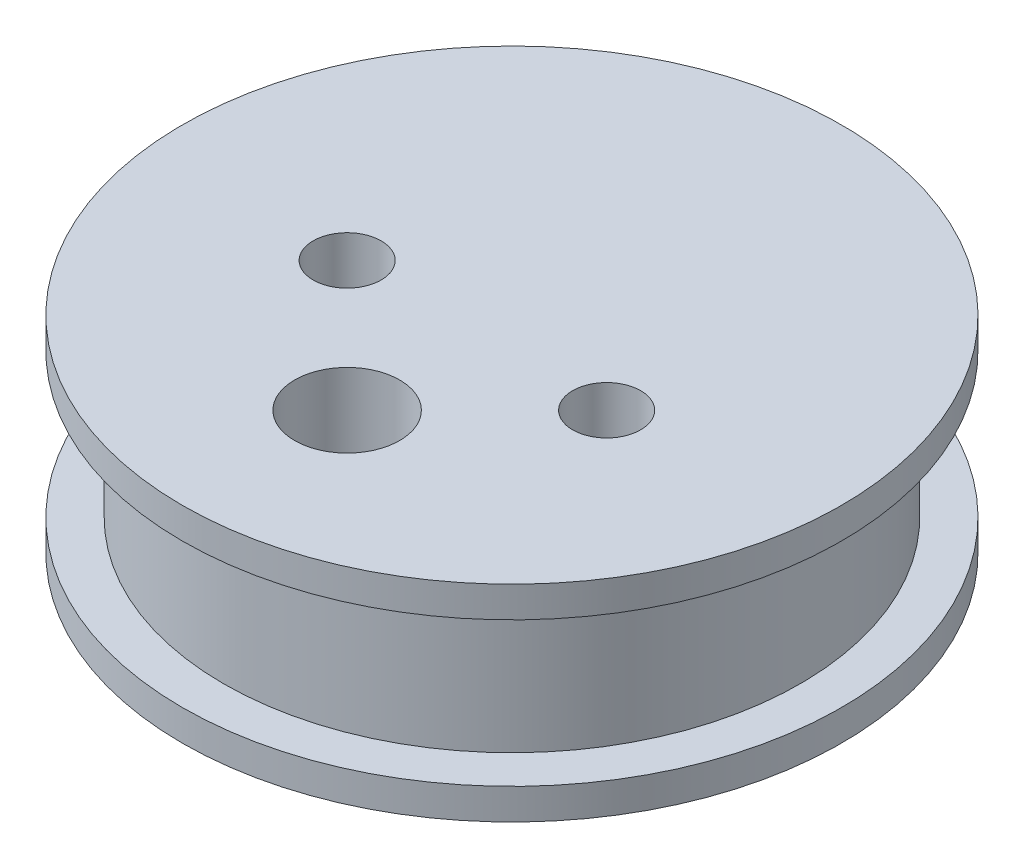
ISO-10303-21;
HEADER;
FILE_DESCRIPTION(('STEP AP214'),'2;1');
FILE_NAME('part.step','',(''),(''),'','','');
FILE_SCHEMA(('AUTOMOTIVE_DESIGN { 1 0 10303 214 1 1 1 1 }'));
ENDSEC;
DATA;
#1=APPLICATION_CONTEXT('core data for automotive mechanical design processes');
#2=APPLICATION_PROTOCOL_DEFINITION('international standard','automotive_design',2000,#1);
#3=PRODUCT_CONTEXT('',#1,'mechanical');
#4=PRODUCT('Part','Part','',(#3));
#5=PRODUCT_RELATED_PRODUCT_CATEGORY('part','',(#4));
#6=PRODUCT_DEFINITION_FORMATION('','',#4);
#7=PRODUCT_DEFINITION_CONTEXT('part definition',#1,'design');
#8=PRODUCT_DEFINITION('design','',#6,#7);
#9=PRODUCT_DEFINITION_SHAPE('','',#8);
#10=(LENGTH_UNIT() NAMED_UNIT(*) SI_UNIT(.MILLI.,.METRE.));
#11=(NAMED_UNIT(*) PLANE_ANGLE_UNIT() SI_UNIT($,.RADIAN.));
#12=(NAMED_UNIT(*) SI_UNIT($,.STERADIAN.) SOLID_ANGLE_UNIT());
#13=UNCERTAINTY_MEASURE_WITH_UNIT(LENGTH_MEASURE(1.E-05),#10,'distance_accuracy_value','');
#14=(GEOMETRIC_REPRESENTATION_CONTEXT(3) GLOBAL_UNCERTAINTY_ASSIGNED_CONTEXT((#13)) GLOBAL_UNIT_ASSIGNED_CONTEXT((#10,
#11,#12)) REPRESENTATION_CONTEXT('',''));
#15=CARTESIAN_POINT('',(0.,0.,0.));
#16=DIRECTION('',(0.,0.,1.));
#17=DIRECTION('',(1.,0.,0.));
#18=AXIS2_PLACEMENT_3D('',#15,#16,#17);
#19=CARTESIAN_POINT('',(30.48,-1.36144358154197,0.));
#20=DIRECTION('',(0.,1.,0.));
#21=DIRECTION('',(0.,0.,1.));
#22=AXIS2_PLACEMENT_3D('',#19,#20,#21);
#23=PLANE('',#22);
#24=CARTESIAN_POINT('',(30.48,-1.36144358154198,10.16));
#25=DIRECTION('',(0.,1.,0.));
#26=DIRECTION('',(-1.,0.,0.));
#27=AXIS2_PLACEMENT_3D('',#24,#25,#26);
#28=CIRCLE('',#27,3.2385);
#29=CARTESIAN_POINT('',(27.2415,-1.36144358154198,10.16));
#30=VERTEX_POINT('',#29);
#31=EDGE_CURVE('E72',#30,#30,#28,.T.);
#32=ORIENTED_EDGE('',*,*,#31,.T.);
#33=EDGE_LOOP('',(#32));
#34=FACE_BOUND('',#33,.T.);
#35=CARTESIAN_POINT('',(22.48,-1.36144358154198,2.16));
#36=DIRECTION('',(0.,1.,0.));
#37=DIRECTION('',(-1.,0.,0.));
#38=AXIS2_PLACEMENT_3D('',#35,#36,#37);
#39=CIRCLE('',#38,2.0955);
#40=CARTESIAN_POINT('',(20.3845,-1.36144358154198,2.16));
#41=VERTEX_POINT('',#40);
#42=EDGE_CURVE('E81',#41,#41,#39,.T.);
#43=ORIENTED_EDGE('',*,*,#42,.T.);
#44=EDGE_LOOP('',(#43));
#45=FACE_BOUND('',#44,.T.);
#46=CARTESIAN_POINT('',(38.48,-1.36144358154197,2.16));
#47=DIRECTION('',(0.,1.,0.));
#48=DIRECTION('',(-1.,0.,0.));
#49=AXIS2_PLACEMENT_3D('',#46,#47,#48);
#50=CIRCLE('',#49,2.0955);
#51=CARTESIAN_POINT('',(36.3845,-1.36144358154197,2.16));
#52=VERTEX_POINT('',#51);
#53=EDGE_CURVE('E73',#52,#52,#50,.T.);
#54=ORIENTED_EDGE('',*,*,#53,.T.);
#55=EDGE_LOOP('',(#54));
#56=FACE_BOUND('',#55,.T.);
#57=CARTESIAN_POINT('',(30.48,-1.36144358154197,0.));
#58=DIRECTION('',(0.,1.,0.));
#59=DIRECTION('',(0.,0.,1.));
#60=AXIS2_PLACEMENT_3D('',#57,#58,#59);
#61=CIRCLE('',#60,20.32);
#62=CARTESIAN_POINT('',(30.48,-1.36144358154197,20.32));
#63=VERTEX_POINT('',#62);
#64=EDGE_CURVE('E10',#63,#63,#61,.T.);
#65=ORIENTED_EDGE('',*,*,#64,.F.);
#66=EDGE_LOOP('',(#65));
#67=FACE_BOUND('',#66,.T.);
#68=ADVANCED_FACE('F41',(#34,#45,#56,#67),#23,.F.);
#69=CARTESIAN_POINT('',(30.48,11.338556418458,0.));
#70=DIRECTION('',(0.,1.,0.));
#71=DIRECTION('',(0.,0.,1.));
#72=AXIS2_PLACEMENT_3D('',#69,#70,#71);
#73=CYLINDRICAL_SURFACE('',#72,20.32);
#74=CARTESIAN_POINT('',(30.48,0.543556418458027,0.));
#75=DIRECTION('',(0.,1.,0.));
#76=DIRECTION('',(0.,0.,1.));
#77=AXIS2_PLACEMENT_3D('',#74,#75,#76);
#78=CIRCLE('',#77,20.32);
#79=CARTESIAN_POINT('',(30.48,0.543556418458027,20.32));
#80=VERTEX_POINT('',#79);
#81=EDGE_CURVE('E48',#80,#80,#78,.T.);
#82=ORIENTED_EDGE('',*,*,#81,.F.);
#83=EDGE_LOOP('',(#82));
#84=FACE_BOUND('',#83,.T.);
#85=ORIENTED_EDGE('',*,*,#64,.T.);
#86=EDGE_LOOP('',(#85));
#87=FACE_BOUND('',#86,.T.);
#88=ADVANCED_FACE('F137',(#84,#87),#73,.T.);
#89=CARTESIAN_POINT('',(50.8,0.543556418458027,0.));
#90=DIRECTION('',(0.,-1.,0.));
#91=DIRECTION('',(0.,0.,-1.));
#92=AXIS2_PLACEMENT_3D('',#89,#90,#91);
#93=PLANE('',#92);
#94=CARTESIAN_POINT('',(30.48,0.543556418458026,0.));
#95=DIRECTION('',(0.,1.,0.));
#96=DIRECTION('',(0.,0.,1.));
#97=AXIS2_PLACEMENT_3D('',#94,#95,#96);
#98=CIRCLE('',#97,17.78);
#99=CARTESIAN_POINT('',(30.48,0.543556418458026,17.78));
#100=VERTEX_POINT('',#99);
#101=EDGE_CURVE('E53',#100,#100,#98,.T.);
#102=ORIENTED_EDGE('',*,*,#101,.F.);
#103=EDGE_LOOP('',(#102));
#104=FACE_BOUND('',#103,.T.);
#105=ORIENTED_EDGE('',*,*,#81,.T.);
#106=EDGE_LOOP('',(#105));
#107=FACE_BOUND('',#106,.T.);
#108=ADVANCED_FACE('F132',(#104,#107),#93,.F.);
#109=CARTESIAN_POINT('',(30.48,11.338556418458,0.));
#110=DIRECTION('',(0.,1.,0.));
#111=DIRECTION('',(0.,0.,1.));
#112=AXIS2_PLACEMENT_3D('',#109,#110,#111);
#113=CYLINDRICAL_SURFACE('',#112,17.78);
#114=CARTESIAN_POINT('',(30.48,9.43355641845802,0.));
#115=DIRECTION('',(0.,1.,0.));
#116=DIRECTION('',(0.,0.,1.));
#117=AXIS2_PLACEMENT_3D('',#114,#115,#116);
#118=CIRCLE('',#117,17.78);
#119=CARTESIAN_POINT('',(30.48,9.43355641845802,17.78));
#120=VERTEX_POINT('',#119);
#121=EDGE_CURVE('E58',#120,#120,#118,.T.);
#122=ORIENTED_EDGE('',*,*,#121,.F.);
#123=EDGE_LOOP('',(#122));
#124=FACE_BOUND('',#123,.T.);
#125=ORIENTED_EDGE('',*,*,#101,.T.);
#126=EDGE_LOOP('',(#125));
#127=FACE_BOUND('',#126,.T.);
#128=ADVANCED_FACE('F126',(#124,#127),#113,.T.);
#129=CARTESIAN_POINT('',(48.26,9.43355641845802,0.));
#130=DIRECTION('',(0.,1.,0.));
#131=DIRECTION('',(0.,0.,1.));
#132=AXIS2_PLACEMENT_3D('',#129,#130,#131);
#133=PLANE('',#132);
#134=CARTESIAN_POINT('',(30.48,9.43355641845802,0.));
#135=DIRECTION('',(0.,1.,0.));
#136=DIRECTION('',(0.,0.,1.));
#137=AXIS2_PLACEMENT_3D('',#134,#135,#136);
#138=CIRCLE('',#137,20.32);
#139=CARTESIAN_POINT('',(30.48,9.43355641845802,20.32));
#140=VERTEX_POINT('',#139);
#141=EDGE_CURVE('E64',#140,#140,#138,.T.);
#142=ORIENTED_EDGE('',*,*,#141,.F.);
#143=EDGE_LOOP('',(#142));
#144=FACE_BOUND('',#143,.T.);
#145=ORIENTED_EDGE('',*,*,#121,.T.);
#146=EDGE_LOOP('',(#145));
#147=FACE_BOUND('',#146,.T.);
#148=ADVANCED_FACE('F120',(#144,#147),#133,.F.);
#149=CARTESIAN_POINT('',(30.48,11.338556418458,0.));
#150=DIRECTION('',(0.,1.,0.));
#151=DIRECTION('',(0.,0.,1.));
#152=AXIS2_PLACEMENT_3D('',#149,#150,#151);
#153=CYLINDRICAL_SURFACE('',#152,20.32);
#154=CARTESIAN_POINT('',(30.48,11.338556418458,0.));
#155=DIRECTION('',(0.,1.,0.));
#156=DIRECTION('',(0.,0.,1.));
#157=AXIS2_PLACEMENT_3D('',#154,#155,#156);
#158=CIRCLE('',#157,20.32);
#159=CARTESIAN_POINT('',(30.48,11.338556418458,20.32));
#160=VERTEX_POINT('',#159);
#161=EDGE_CURVE('E68',#160,#160,#158,.T.);
#162=ORIENTED_EDGE('',*,*,#161,.F.);
#163=EDGE_LOOP('',(#162));
#164=FACE_BOUND('',#163,.T.);
#165=ORIENTED_EDGE('',*,*,#141,.T.);
#166=EDGE_LOOP('',(#165));
#167=FACE_BOUND('',#166,.T.);
#168=ADVANCED_FACE('F110',(#164,#167),#153,.T.);
#169=CARTESIAN_POINT('',(50.8,11.338556418458,0.));
#170=DIRECTION('',(0.,-1.,0.));
#171=DIRECTION('',(0.,0.,-1.));
#172=AXIS2_PLACEMENT_3D('',#169,#170,#171);
#173=PLANE('',#172);
#174=CARTESIAN_POINT('',(30.48,11.338556418458,10.16));
#175=DIRECTION('',(0.,1.,0.));
#176=DIRECTION('',(-1.,0.,0.));
#177=AXIS2_PLACEMENT_3D('',#174,#175,#176);
#178=CIRCLE('',#177,3.2385);
#179=CARTESIAN_POINT('',(27.2415,11.338556418458,10.16));
#180=VERTEX_POINT('',#179);
#181=EDGE_CURVE('E89',#180,#180,#178,.T.);
#182=ORIENTED_EDGE('',*,*,#181,.F.);
#183=EDGE_LOOP('',(#182));
#184=FACE_BOUND('',#183,.T.);
#185=CARTESIAN_POINT('',(22.48,11.338556418458,2.16));
#186=DIRECTION('',(0.,1.,0.));
#187=DIRECTION('',(-1.,0.,0.));
#188=AXIS2_PLACEMENT_3D('',#185,#186,#187);
#189=CIRCLE('',#188,2.0955);
#190=CARTESIAN_POINT('',(20.3845,11.338556418458,2.16));
#191=VERTEX_POINT('',#190);
#192=EDGE_CURVE('E85',#191,#191,#189,.T.);
#193=ORIENTED_EDGE('',*,*,#192,.F.);
#194=EDGE_LOOP('',(#193));
#195=FACE_BOUND('',#194,.T.);
#196=CARTESIAN_POINT('',(38.48,11.338556418458,2.16));
#197=DIRECTION('',(0.,1.,0.));
#198=DIRECTION('',(-1.,0.,0.));
#199=AXIS2_PLACEMENT_3D('',#196,#197,#198);
#200=CIRCLE('',#199,2.0955);
#201=CARTESIAN_POINT('',(36.3845,11.338556418458,2.16));
#202=VERTEX_POINT('',#201);
#203=EDGE_CURVE('E77',#202,#202,#200,.T.);
#204=ORIENTED_EDGE('',*,*,#203,.F.);
#205=EDGE_LOOP('',(#204));
#206=FACE_BOUND('',#205,.T.);
#207=ORIENTED_EDGE('',*,*,#161,.T.);
#208=EDGE_LOOP('',(#207));
#209=FACE_BOUND('',#208,.T.);
#210=ADVANCED_FACE('F106',(#184,#195,#206,#209),#173,.F.);
#211=CARTESIAN_POINT('',(38.48,-1.36144358154197,2.16));
#212=DIRECTION('',(0.,1.,0.));
#213=DIRECTION('',(-1.,0.,0.));
#214=AXIS2_PLACEMENT_3D('',#211,#212,#213);
#215=CYLINDRICAL_SURFACE('',#214,2.0955);
#216=ORIENTED_EDGE('',*,*,#53,.F.);
#217=EDGE_LOOP('',(#216));
#218=FACE_BOUND('',#217,.T.);
#219=ORIENTED_EDGE('',*,*,#203,.T.);
#220=EDGE_LOOP('',(#219));
#221=FACE_BOUND('',#220,.T.);
#222=ADVANCED_FACE('F109',(#218,#221),#215,.F.);
#223=CARTESIAN_POINT('',(22.48,-1.36144358154198,2.16));
#224=DIRECTION('',(0.,1.,0.));
#225=DIRECTION('',(-1.,0.,0.));
#226=AXIS2_PLACEMENT_3D('',#223,#224,#225);
#227=CYLINDRICAL_SURFACE('',#226,2.0955);
#228=ORIENTED_EDGE('',*,*,#42,.F.);
#229=EDGE_LOOP('',(#228));
#230=FACE_BOUND('',#229,.T.);
#231=ORIENTED_EDGE('',*,*,#192,.T.);
#232=EDGE_LOOP('',(#231));
#233=FACE_BOUND('',#232,.T.);
#234=ADVANCED_FACE('F102',(#230,#233),#227,.F.);
#235=CARTESIAN_POINT('',(30.48,-1.36144358154198,10.16));
#236=DIRECTION('',(0.,1.,0.));
#237=DIRECTION('',(-1.,0.,0.));
#238=AXIS2_PLACEMENT_3D('',#235,#236,#237);
#239=CYLINDRICAL_SURFACE('',#238,3.2385);
#240=ORIENTED_EDGE('',*,*,#31,.F.);
#241=EDGE_LOOP('',(#240));
#242=FACE_BOUND('',#241,.T.);
#243=ORIENTED_EDGE('',*,*,#181,.T.);
#244=EDGE_LOOP('',(#243));
#245=FACE_BOUND('',#244,.T.);
#246=ADVANCED_FACE('F99',(#242,#245),#239,.F.);
#247=CLOSED_SHELL('',(#68,#88,#108,#128,#148,#168,#210,#222,#234,#246));
#248=MANIFOLD_SOLID_BREP('B2',#247);
#249=ADVANCED_BREP_SHAPE_REPRESENTATION('',(#18,#248),#14);
#250=SHAPE_DEFINITION_REPRESENTATION(#9,#249);
ENDSEC;
END-ISO-10303-21;
